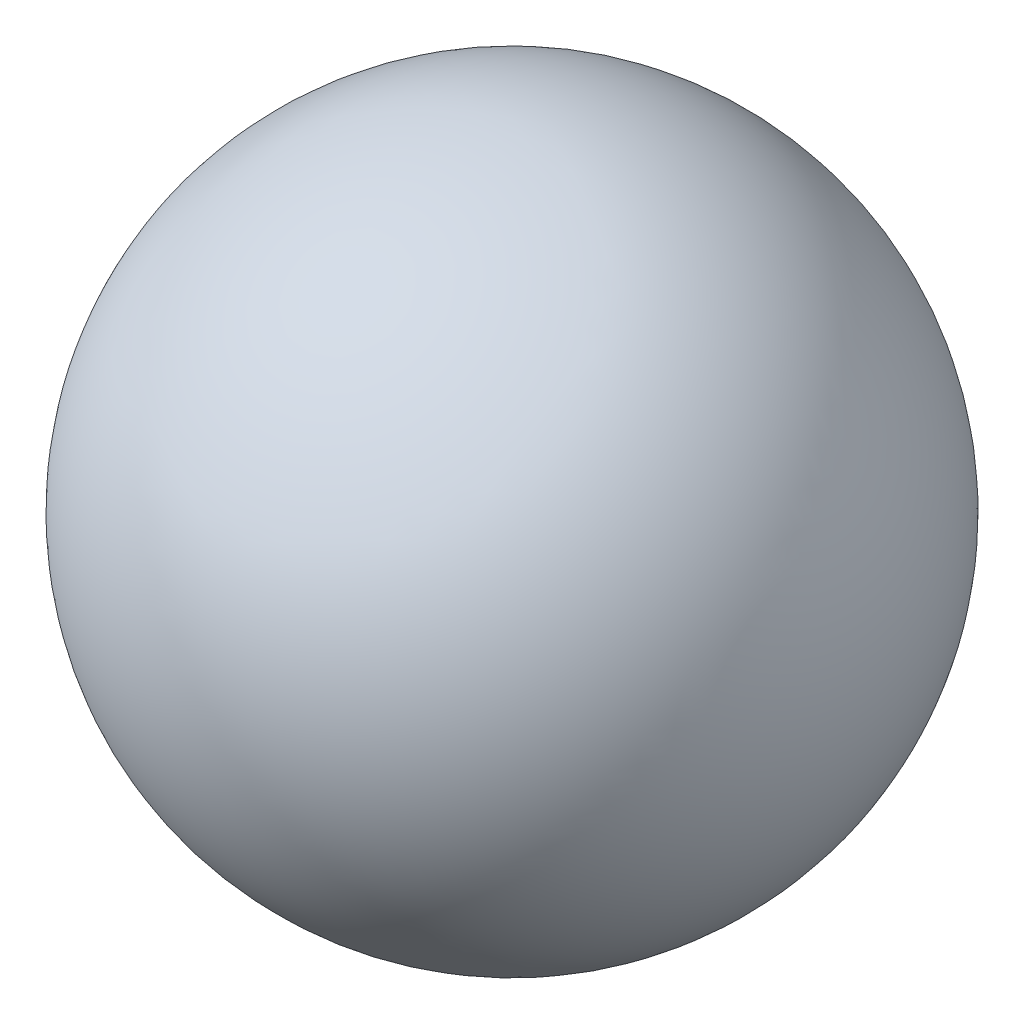
ISO-10303-21;
HEADER;
FILE_DESCRIPTION(('STEP AP214'),'2;1');
FILE_NAME('part.step','',(''),(''),'','','');
FILE_SCHEMA(('AUTOMOTIVE_DESIGN { 1 0 10303 214 1 1 1 1 }'));
ENDSEC;
DATA;
#1=APPLICATION_CONTEXT('core data for automotive mechanical design processes');
#2=APPLICATION_PROTOCOL_DEFINITION('international standard','automotive_design',2000,#1);
#3=PRODUCT_CONTEXT('',#1,'mechanical');
#4=PRODUCT('Part','Part','',(#3));
#5=PRODUCT_RELATED_PRODUCT_CATEGORY('part','',(#4));
#6=PRODUCT_DEFINITION_FORMATION('','',#4);
#7=PRODUCT_DEFINITION_CONTEXT('part definition',#1,'design');
#8=PRODUCT_DEFINITION('design','',#6,#7);
#9=PRODUCT_DEFINITION_SHAPE('','',#8);
#10=(LENGTH_UNIT() NAMED_UNIT(*) SI_UNIT(.MILLI.,.METRE.));
#11=(NAMED_UNIT(*) PLANE_ANGLE_UNIT() SI_UNIT($,.RADIAN.));
#12=(NAMED_UNIT(*) SI_UNIT($,.STERADIAN.) SOLID_ANGLE_UNIT());
#13=UNCERTAINTY_MEASURE_WITH_UNIT(LENGTH_MEASURE(1.E-05),#10,'distance_accuracy_value','');
#14=(GEOMETRIC_REPRESENTATION_CONTEXT(3) GLOBAL_UNCERTAINTY_ASSIGNED_CONTEXT((#13)) GLOBAL_UNIT_ASSIGNED_CONTEXT((#10,
#11,#12)) REPRESENTATION_CONTEXT('',''));
#15=CARTESIAN_POINT('',(0.,0.,0.));
#16=DIRECTION('',(0.,0.,1.));
#17=DIRECTION('',(1.,0.,0.));
#18=AXIS2_PLACEMENT_3D('',#15,#16,#17);
#19=CARTESIAN_POINT('',(0.,0.,0.));
#20=DIRECTION('',(-1.,0.,0.));
#21=DIRECTION('',(0.,0.,-1.));
#22=AXIS2_PLACEMENT_3D('',#19,#20,#21);
#23=SPHERICAL_SURFACE('',#22,47.625);
#24=CARTESIAN_POINT('',(-47.625,0.,0.));
#25=VERTEX_POINT('',#24);
#26=VERTEX_LOOP('',#25);
#27=FACE_BOUND('',#26,.T.);
#28=ADVANCED_FACE('F33',(#27),#23,.T.);
#29=CLOSED_SHELL('',(#28));
#30=MANIFOLD_SOLID_BREP('B2',#29);
#31=ADVANCED_BREP_SHAPE_REPRESENTATION('',(#18,#30),#14);
#32=SHAPE_DEFINITION_REPRESENTATION(#9,#31);
ENDSEC;
END-ISO-10303-21;
